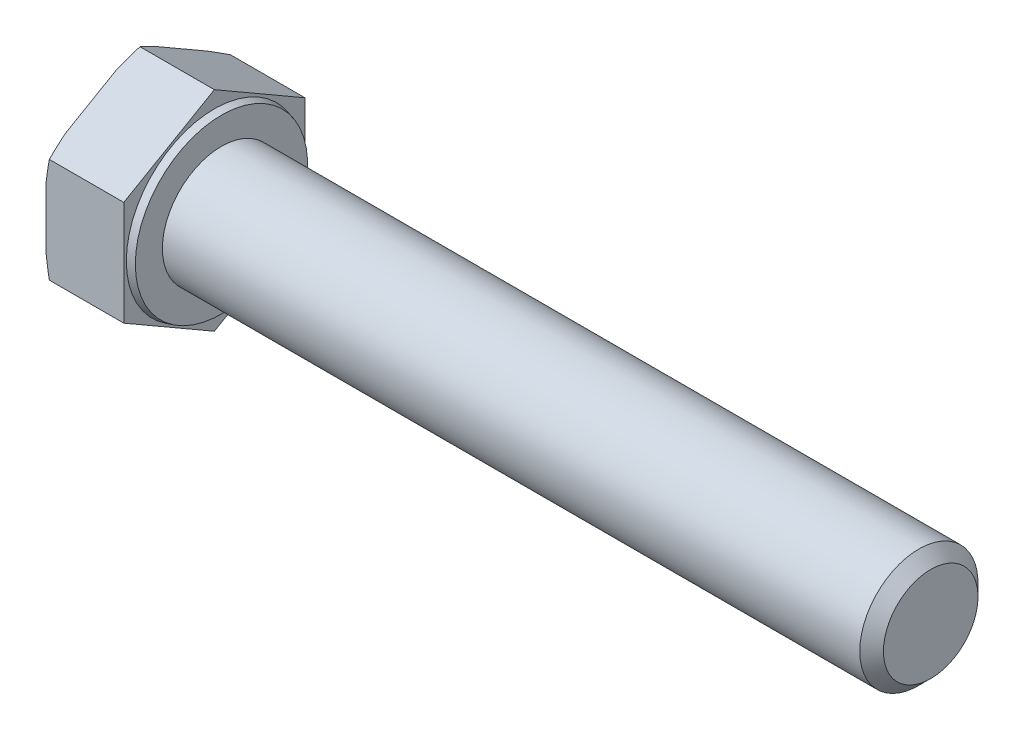
ISO-10303-21;
HEADER;
FILE_DESCRIPTION(('STEP AP214'),'2;1');
FILE_NAME('part.step','',(''),(''),'','','');
FILE_SCHEMA(('AUTOMOTIVE_DESIGN { 1 0 10303 214 1 1 1 1 }'));
ENDSEC;
DATA;
#1=APPLICATION_CONTEXT('core data for automotive mechanical design processes');
#2=APPLICATION_PROTOCOL_DEFINITION('international standard','automotive_design',2000,#1);
#3=PRODUCT_CONTEXT('',#1,'mechanical');
#4=PRODUCT('Part','Part','',(#3));
#5=PRODUCT_RELATED_PRODUCT_CATEGORY('part','',(#4));
#6=PRODUCT_DEFINITION_FORMATION('','',#4);
#7=PRODUCT_DEFINITION_CONTEXT('part definition',#1,'design');
#8=PRODUCT_DEFINITION('design','',#6,#7);
#9=PRODUCT_DEFINITION_SHAPE('','',#8);
#10=(LENGTH_UNIT() NAMED_UNIT(*) SI_UNIT(.MILLI.,.METRE.));
#11=(NAMED_UNIT(*) PLANE_ANGLE_UNIT() SI_UNIT($,.RADIAN.));
#12=(NAMED_UNIT(*) SI_UNIT($,.STERADIAN.) SOLID_ANGLE_UNIT());
#13=UNCERTAINTY_MEASURE_WITH_UNIT(LENGTH_MEASURE(1.E-05),#10,'distance_accuracy_value','');
#14=(GEOMETRIC_REPRESENTATION_CONTEXT(3) GLOBAL_UNCERTAINTY_ASSIGNED_CONTEXT((#13)) GLOBAL_UNIT_ASSIGNED_CONTEXT((#10,
#11,#12)) REPRESENTATION_CONTEXT('',''));
#15=CARTESIAN_POINT('',(0.,0.,0.));
#16=DIRECTION('',(0.,0.,1.));
#17=DIRECTION('',(1.,0.,0.));
#18=AXIS2_PLACEMENT_3D('',#15,#16,#17);
#19=CARTESIAN_POINT('',(60.6,-4.42500000000009,-7.66432482349223));
#20=DIRECTION('',(0.,-0.866025403784441,-0.499999999999995));
#21=DIRECTION('',(0.,0.499999999999995,-0.866025403784442));
#22=AXIS2_PLACEMENT_3D('',#19,#20,#21);
#23=PLANE('',#22);
#24=DIRECTION('',(-1.,0.,0.));
#25=VECTOR('',#24,1.);
#26=CARTESIAN_POINT('',(60.6,-8.85,0.));
#27=LINE('',#26,#25);
#28=CARTESIAN_POINT('',(0.,-8.85,0.));
#29=VERTEX_POINT('',#28);
#30=CARTESIAN_POINT('',(-6.29792306844368,-8.85,0.));
#31=VERTEX_POINT('',#30);
#32=EDGE_CURVE('E157',#29,#31,#27,.T.);
#33=ORIENTED_EDGE('',*,*,#32,.T.);
#34=CARTESIAN_POINT('',(-4.7699615006699,-11.9174022332107,5.3128965151713));
#35=CARTESIAN_POINT('',(-4.83614833570257,-11.8050473190038,5.11829209528478));
#36=CARTESIAN_POINT('',(-4.90167255003095,-11.6925948603644,4.92351872348535));
#37=CARTESIAN_POINT('',(-5.03118559698242,-11.4674663528304,4.53358471020429));
#38=CARTESIAN_POINT('',(-5.09517439305191,-11.3547902986816,4.33842405962226));
#39=CARTESIAN_POINT('',(-5.28456041407138,-11.0163157536771,3.75216895060564));
#40=CARTESIAN_POINT('',(-5.40733223857273,-10.7901468045144,3.3604328395613));
#41=CARTESIAN_POINT('',(-5.6448059473252,-10.3342684187143,2.57082831328319));
#42=CARTESIAN_POINT('',(-5.75941225873481,-10.1045464495324,2.17293819104533));
#43=CARTESIAN_POINT('',(-5.97591685440881,-9.6436033227612,1.3745612760779));
#44=CARTESIAN_POINT('',(-6.07781581130404,-9.41238224520545,0.974074621970506));
#45=CARTESIAN_POINT('',(-6.26134144326315,-8.95638364479249,0.184261877874952));
#46=CARTESIAN_POINT('',(-6.34355573274743,-8.73166601658845,-0.204960471530827));
#47=CARTESIAN_POINT('',(-6.48746045966097,-8.2805512783751,-0.986314118159489));
#48=CARTESIAN_POINT('',(-6.54915189984519,-8.05415425097467,-1.37844527229961));
#49=CARTESIAN_POINT('',(-6.62254434564547,-7.71410474496151,-1.96742829380309));
#50=CARTESIAN_POINT('',(-6.64378861584913,-7.60095958105454,-2.16340146632068));
#51=CARTESIAN_POINT('',(-6.67950592063896,-7.37440457175732,-2.55580625313272));
#52=CARTESIAN_POINT('',(-6.69397933196105,-7.26099474144627,-2.75223784130921));
#53=CARTESIAN_POINT('',(-6.71577657593379,-7.03401139991638,-3.14538452131075));
#54=CARTESIAN_POINT('',(-6.72310096885371,-6.92043790222292,-3.34209958970914));
#55=CARTESIAN_POINT('',(-6.73040192529392,-6.69323186195545,-3.73563199523893));
#56=CARTESIAN_POINT('',(-6.73037853713207,-6.57959931977464,-3.93244933168932));
#57=CARTESIAN_POINT('',(-6.72320871548941,-6.35929562962563,-4.31402651612232));
#58=CARTESIAN_POINT('',(-6.71649505277964,-6.25262090601261,-4.49879255730344));
#59=CARTESIAN_POINT('',(-6.69675463432834,-6.03941600442701,-4.86807427927242));
#60=CARTESIAN_POINT('',(-6.68372760236287,-5.93288583298344,-5.05258994875172));
#61=CARTESIAN_POINT('',(-6.63559663675346,-5.61363013252953,-5.60555704254388));
#62=CARTESIAN_POINT('',(-6.59144268713134,-5.40123548697151,-5.97343535990596));
#63=CARTESIAN_POINT('',(-6.48226269320506,-4.97681311893133,-6.70855646522027));
#64=CARTESIAN_POINT('',(-6.41713860156276,-4.7647919199632,-7.07578795411473));
#65=CARTESIAN_POINT('',(-6.27018625376656,-4.34222339340586,-7.80769811179158));
#66=CARTESIAN_POINT('',(-6.18835790112246,-4.1316760743376,-8.17237676581522));
#67=CARTESIAN_POINT('',(-6.00866271800198,-3.70472589760515,-8.91187616421634));
#68=CARTESIAN_POINT('',(-5.91033992742069,-3.48837165185492,-9.286612710289));
#69=CARTESIAN_POINT('',(-5.70311989656312,-3.05693413716248,-10.0338844060276));
#70=CARTESIAN_POINT('',(-5.59422212603359,-2.84185093252738,-10.4064194443103));
#71=CARTESIAN_POINT('',(-5.36943684134144,-2.41473283183158,-11.1462096955477));
#72=CARTESIAN_POINT('',(-5.25362330968472,-2.2026881429877,-11.5134818701005));
#73=CARTESIAN_POINT('',(-5.07537550670142,-1.88529185166037,-12.0632283728134));
#74=CARTESIAN_POINT('',(-5.01521325258259,-1.77961882394802,-12.2462594258008));
#75=CARTESIAN_POINT('',(-4.89354912869936,-1.56846779942573,-12.6119837283436));
#76=CARTESIAN_POINT('',(-4.83204728425027,-1.462989798971,-12.794676984212));
#77=CARTESIAN_POINT('',(-4.7699615006699,-1.35759776678936,-12.9772213386635));
#78=B_SPLINE_CURVE_WITH_KNOTS('',3,(#34,#35,#36,#37,#38,#39,#40,#41,#42,#43,#44,#45,#46,#47,#48,
#49,#50,#51,#52,#53,#54,#55,#56,#57,#58,#59,#60,#61,#62,#63,#64,#65,#66,#67,#68,#69,#70,#71,#72,
#73,#74,#75,#76,#77),.UNSPECIFIED.,.F.,.F.,(4,2,2,2,2,2,2,2,2,2,2,2,2,2,2,2,2,2,2,2,2,4),(0.,
0.70276173034238,1.40554017472233,2.81157217612387,4.23201032618944,5.6523732571052,
7.02270828812481,8.39297635416766,9.07474696516833,9.75647963740091,10.438158877887,
11.119833635759,11.7601005309412,12.4003954417532,13.6809617128842,14.9676044823533,
16.2542546841745,17.5852978857349,18.9164078632869,20.2352036230902,20.894426976119,
21.553637882061),.UNSPECIFIED.);
#79=CARTESIAN_POINT('',(-6.58000000000003,-7.90869530364146,-1.63038755949604));
#80=VERTEX_POINT('',#79);
#81=EDGE_CURVE('E202',#31,#80,#78,.T.);
#82=ORIENTED_EDGE('',*,*,#81,.T.);
#83=DIRECTION('',(0.,-0.499999999999995,0.866025403784442));
#84=VECTOR('',#83,1.);
#85=CARTESIAN_POINT('',(-6.58,-4.42500000000009,-7.66432482349223));
#86=LINE('',#85,#84);
#87=CARTESIAN_POINT('',(-6.58,-5.36630469635854,-6.03393726399618));
#88=VERTEX_POINT('',#87);
#89=EDGE_CURVE('E212',#88,#80,#86,.T.);
#90=ORIENTED_EDGE('',*,*,#89,.F.);
#91=CARTESIAN_POINT('',(-6.29792306844368,-4.42500000000009,-7.66432482349223));
#92=VERTEX_POINT('',#91);
#93=EDGE_CURVE('E215',#88,#92,#78,.T.);
#94=ORIENTED_EDGE('',*,*,#93,.T.);
#95=DIRECTION('',(-1.,0.,0.));
#96=VECTOR('',#95,1.);
#97=CARTESIAN_POINT('',(60.6,-4.42500000000009,-7.66432482349223));
#98=LINE('',#97,#96);
#99=CARTESIAN_POINT('',(0.,-4.42500000000009,-7.66432482349223));
#100=VERTEX_POINT('',#99);
#101=EDGE_CURVE('E168',#100,#92,#98,.T.);
#102=ORIENTED_EDGE('',*,*,#101,.F.);
#103=DIRECTION('',(0.,-0.499999999999995,0.866025403784442));
#104=VECTOR('',#103,1.);
#105=CARTESIAN_POINT('',(0.,-4.42500000000009,-7.66432482349223));
#106=LINE('',#105,#104);
#107=EDGE_CURVE('E183',#100,#29,#106,.T.);
#108=ORIENTED_EDGE('',*,*,#107,.T.);
#109=EDGE_LOOP('',(#33,#82,#90,#94,#102,#108));
#110=FACE_BOUND('',#109,.T.);
#111=ADVANCED_FACE('F35',(#110),#23,.T.);
#112=CARTESIAN_POINT('',(60.6,4.42499999999993,-7.66432482349232));
#113=DIRECTION('',(0.,0.,-1.));
#114=DIRECTION('',(0.,1.,0.));
#115=AXIS2_PLACEMENT_3D('',#112,#113,#114);
#116=PLANE('',#115);
#117=ORIENTED_EDGE('',*,*,#101,.T.);
#118=CARTESIAN_POINT('',(-5.00864005639831,-9.73789651517145,-7.66432482349217));
#119=CARTESIAN_POINT('',(-5.07003318744064,-9.52322769233334,-7.66432482349218));
#120=CARTESIAN_POINT('',(-5.13071664914256,-9.30835600664128,-7.66432482349218));
#121=CARTESIAN_POINT('',(-5.2504442425723,-8.87815277711283,-7.66432482349218));
#122=CARTESIAN_POINT('',(-5.30948834652955,-8.66282122555281,-7.66432482349219));
#123=CARTESIAN_POINT('',(-5.48387527888684,-8.01589307910885,-7.66432482349219));
#124=CARTESIAN_POINT('',(-5.59642298983084,-7.58353558067021,-7.6643248234922));
#125=CARTESIAN_POINT('',(-5.81266226723173,-6.71259000391773,-7.66432482349221));
#126=CARTESIAN_POINT('',(-5.91626806915323,-6.27398046842187,-7.66432482349221));
#127=CARTESIAN_POINT('',(-6.11029091280608,-5.39384656433909,-7.66432482349222));
#128=CARTESIAN_POINT('',(-6.20070892550878,-4.95232241284974,-7.66432482349222));
#129=CARTESIAN_POINT('',(-6.36160933963008,-4.08051166755351,-7.66432482349223));
#130=CARTESIAN_POINT('',(-6.43264625776086,-3.65032885049375,-7.66432482349224));
#131=CARTESIAN_POINT('',(-6.55428187483288,-2.78707107422335,-7.66432482349225));
#132=CARTESIAN_POINT('',(-6.60488453148917,-2.35399669158535,-7.66432482349225));
#133=CARTESIAN_POINT('',(-6.66240831794471,-1.70368188145931,-7.66432482349226));
#134=CARTESIAN_POINT('',(-6.67850532779577,-1.48723464984804,-7.66432482349226));
#135=CARTESIAN_POINT('',(-6.70429433272965,-1.05396299728827,-7.66432482349227));
#136=CARTESIAN_POINT('',(-6.71398664875919,-0.837138595786226,-7.66432482349227));
#137=CARTESIAN_POINT('',(-6.72672253024382,-0.403302294793051,-7.66432482349227));
#138=CARTESIAN_POINT('',(-6.72976638437883,-0.186290403852155,-7.66432482349227));
#139=CARTESIAN_POINT('',(-6.7291358967764,0.247718950123678,-7.66432482349228));
#140=CARTESIAN_POINT('',(-6.72546155695146,0.464716413162706,-7.66432482349228));
#141=CARTESIAN_POINT('',(-6.70624362970486,1.06036953223341,-7.66432482349229));
#142=CARTESIAN_POINT('',(-6.68388895075078,1.43882252598365,-7.66432482349229));
#143=CARTESIAN_POINT('',(-6.62050559151052,2.19412494594648,-7.6643248234923));
#144=CARTESIAN_POINT('',(-6.57947609181733,2.57097430106276,-7.6643248234923));
#145=CARTESIAN_POINT('',(-6.48113797206862,3.32388976987407,-7.66432482349231));
#146=CARTESIAN_POINT('',(-6.4237712185853,3.69994816672772,-7.66432482349232));
#147=CARTESIAN_POINT('',(-6.2956564145037,4.44978573942378,-7.66432482349232));
#148=CARTESIAN_POINT('',(-6.22490691200718,4.82356466341955,-7.66432482349233));
#149=CARTESIAN_POINT('',(-6.0704014797458,5.58003633732887,-7.66432482349234));
#150=CARTESIAN_POINT('',(-5.98632024183774,5.96266195818458,-7.66432482349234));
#151=CARTESIAN_POINT('',(-5.80919867667365,6.72583533235177,-7.66432482349235));
#152=CARTESIAN_POINT('',(-5.71615790531566,7.10638298167437,-7.66432482349235));
#153=CARTESIAN_POINT('',(-5.52374117974904,7.86297645537245,-7.66432482349236));
#154=CARTESIAN_POINT('',(-5.42441511026811,8.23903503370974,-7.66432482349236));
#155=CARTESIAN_POINT('',(-5.27134102225385,8.80195695976291,-7.66432482349237));
#156=CARTESIAN_POINT('',(-5.21964171692946,8.98938164843282,-7.66432482349237));
#157=CARTESIAN_POINT('',(-5.11502150400523,9.36388780999383,-7.66432482349237));
#158=CARTESIAN_POINT('',(-5.06210060924165,9.55096928646908,-7.66432482349238));
#159=CARTESIAN_POINT('',(-5.00864005639831,9.73789651517129,-7.66432482349238));
#160=B_SPLINE_CURVE_WITH_KNOTS('',3,(#118,#119,#120,#121,#122,#123,#124,#125,#126,#127,#128,
#129,#130,#131,#132,#133,#134,#135,#136,#137,#138,#139,#140,#141,#142,#143,#144,#145,#146,#147,
#148,#149,#150,#151,#152,#153,#154,#155,#156,#157,#158,#159),.UNSPECIFIED.,.F.,.F.,(4,2,2,2,2,2,
2,2,2,2,2,2,2,2,2,2,2,2,2,2,4),(0.,0.669823290546161,1.33965792092904,2.67986595636369,
4.03175825312792,5.38355096443301,6.69120700403605,7.99860965473741,8.64966414612008,
9.300686009923,9.95167960543101,10.6026730156168,11.7394565125237,12.876289893615,
14.0172201663474,15.1582742899967,16.3334026116279,17.5085892114817,18.6753990362947,
19.2586689197893,19.8419326771629),.UNSPECIFIED.);
#161=CARTESIAN_POINT('',(-6.58000000000003,-2.54239060728318,-7.66432482349217));
#162=VERTEX_POINT('',#161);
#163=EDGE_CURVE('E223',#92,#162,#160,.T.);
#164=ORIENTED_EDGE('',*,*,#163,.T.);
#165=DIRECTION('',(0.,-1.,0.));
#166=VECTOR('',#165,1.);
#167=CARTESIAN_POINT('',(-6.58,4.42499999999993,-7.66432482349232));
#168=LINE('',#167,#166);
#169=CARTESIAN_POINT('',(-6.58,2.54239060728305,-7.6643248234923));
#170=VERTEX_POINT('',#169);
#171=EDGE_CURVE('E163',#170,#162,#168,.T.);
#172=ORIENTED_EDGE('',*,*,#171,.F.);
#173=CARTESIAN_POINT('',(-6.29792306844368,4.42499999999993,-7.66432482349232));
#174=VERTEX_POINT('',#173);
#175=EDGE_CURVE('E50',#170,#174,#160,.T.);
#176=ORIENTED_EDGE('',*,*,#175,.T.);
#177=DIRECTION('',(-1.,0.,0.));
#178=VECTOR('',#177,1.);
#179=CARTESIAN_POINT('',(60.6,4.42499999999993,-7.66432482349232));
#180=LINE('',#179,#178);
#181=CARTESIAN_POINT('',(0.,4.42499999999993,-7.66432482349232));
#182=VERTEX_POINT('',#181);
#183=EDGE_CURVE('E154',#182,#174,#180,.T.);
#184=ORIENTED_EDGE('',*,*,#183,.F.);
#185=DIRECTION('',(0.,-1.,0.));
#186=VECTOR('',#185,1.);
#187=CARTESIAN_POINT('',(0.,8.84999999999992,-7.66432482349237));
#188=LINE('',#187,#186);
#189=EDGE_CURVE('E181',#182,#100,#188,.T.);
#190=ORIENTED_EDGE('',*,*,#189,.T.);
#191=EDGE_LOOP('',(#117,#164,#172,#176,#184,#190));
#192=FACE_BOUND('',#191,.T.);
#193=ADVANCED_FACE('F250',(#192),#116,.T.);
#194=CARTESIAN_POINT('',(60.6,8.85,0.));
#195=DIRECTION('',(0.,0.866025403784434,-0.500000000000007));
#196=DIRECTION('',(0.,0.500000000000007,0.866025403784435));
#197=AXIS2_PLACEMENT_3D('',#194,#195,#196);
#198=PLANE('',#197);
#199=ORIENTED_EDGE('',*,*,#183,.T.);
#200=CARTESIAN_POINT('',(-4.76996150066986,1.35759776678906,-12.9772213386637));
#201=CARTESIAN_POINT('',(-4.83614833570253,1.46995268099604,-12.7826169187772));
#202=CARTESIAN_POINT('',(-4.9016725500309,1.58240513963541,-12.5878435469777));
#203=CARTESIAN_POINT('',(-5.03118559698238,1.80753364716942,-12.1979095336967));
#204=CARTESIAN_POINT('',(-5.09517439305187,1.92020970131819,-12.0027488831146));
#205=CARTESIAN_POINT('',(-5.28456041407135,2.25868424632273,-11.416493774098));
#206=CARTESIAN_POINT('',(-5.40733223857269,2.48485319548548,-11.0247576630537));
#207=CARTESIAN_POINT('',(-5.64480594732518,2.94073158128551,-10.2351531367756));
#208=CARTESIAN_POINT('',(-5.75941225873478,3.17045355046743,-9.83726301453771));
#209=CARTESIAN_POINT('',(-5.97591685440879,3.63139667723867,-9.03888609957028));
#210=CARTESIAN_POINT('',(-6.07781581130402,3.86261775479443,-8.63839944546289));
#211=CARTESIAN_POINT('',(-6.26134144326313,4.3186163552074,-7.84858670136733));
#212=CARTESIAN_POINT('',(-6.34355573274742,4.54333398341145,-7.45936435196155));
#213=CARTESIAN_POINT('',(-6.48746045966097,4.99444872162482,-6.67801070533289));
#214=CARTESIAN_POINT('',(-6.54915189984519,5.22084574902526,-6.28587955119277));
#215=CARTESIAN_POINT('',(-6.62254434564547,5.56089525503842,-5.69689652968929));
#216=CARTESIAN_POINT('',(-6.64378861584913,5.6740404189454,-5.5009233571717));
#217=CARTESIAN_POINT('',(-6.67950592063896,5.90059542824263,-5.10851857035966));
#218=CARTESIAN_POINT('',(-6.69397933196106,6.01400525855368,-4.91208698218317));
#219=CARTESIAN_POINT('',(-6.7157765759338,6.24098860008357,-4.51894030218163));
#220=CARTESIAN_POINT('',(-6.72310096885372,6.35456209777704,-4.32222523378324));
#221=CARTESIAN_POINT('',(-6.73040192529394,6.58176813804451,-3.92869282825345));
#222=CARTESIAN_POINT('',(-6.73037853713208,6.69540068022533,-3.73187549180306));
#223=CARTESIAN_POINT('',(-6.72320871548943,6.91570437037435,-3.35029830737006));
#224=CARTESIAN_POINT('',(-6.71649505277966,7.02237909398737,-3.16553226618894));
#225=CARTESIAN_POINT('',(-6.69675463432836,7.23558399557298,-2.79625054421994));
#226=CARTESIAN_POINT('',(-6.68372760236289,7.34211416701656,-2.61173487474064));
#227=CARTESIAN_POINT('',(-6.63559663675348,7.66136986747048,-2.05876778094847));
#228=CARTESIAN_POINT('',(-6.59144268713136,7.87376451302852,-1.69088946358639));
#229=CARTESIAN_POINT('',(-6.48226269320508,8.29818688106872,-0.955768358272067));
#230=CARTESIAN_POINT('',(-6.41713860156277,8.51020808003686,-0.588536869377594));
#231=CARTESIAN_POINT('',(-6.27018625376657,8.93277660659422,0.143373288299262));
#232=CARTESIAN_POINT('',(-6.18835790112246,9.14332392566248,0.508051942322907));
#233=CARTESIAN_POINT('',(-6.00866271800198,9.57027410239495,1.24755134072404));
#234=CARTESIAN_POINT('',(-5.91033992742068,9.7866283481452,1.62228788679671));
#235=CARTESIAN_POINT('',(-5.7031198965631,10.2180658628377,2.36955958253528));
#236=CARTESIAN_POINT('',(-5.59422212603357,10.4331490674728,2.74209462081801));
#237=CARTESIAN_POINT('',(-5.36943684134141,10.8602671681686,3.48188487205548));
#238=CARTESIAN_POINT('',(-5.25362330968469,11.0723118570125,3.84915704660823));
#239=CARTESIAN_POINT('',(-5.07537550670138,11.3897081483398,4.39890354932111));
#240=CARTESIAN_POINT('',(-5.01521325258256,11.4953811760522,4.58193460230855));
#241=CARTESIAN_POINT('',(-4.89354912869931,11.7065322005745,4.94765890485139));
#242=CARTESIAN_POINT('',(-4.83204728425022,11.8120102010292,5.13035216071975));
#243=CARTESIAN_POINT('',(-4.76996150066986,11.9174022332109,5.3128965151713));
#244=B_SPLINE_CURVE_WITH_KNOTS('',3,(#200,#201,#202,#203,#204,#205,#206,#207,#208,#209,#210,
#211,#212,#213,#214,#215,#216,#217,#218,#219,#220,#221,#222,#223,#224,#225,#226,#227,#228,#229,
#230,#231,#232,#233,#234,#235,#236,#237,#238,#239,#240,#241,#242,#243),.UNSPECIFIED.,.F.,.F.,(4,
2,2,2,2,2,2,2,2,2,2,2,2,2,2,2,2,2,2,2,2,4),(0.,0.702761730342387,1.40554017472235,
2.8115721761239,4.23201032618948,5.65237325710526,7.02270828812488,8.39297635416775,
9.07474696516843,9.75647963740101,10.4381588778871,11.1198336357591,11.7601005309413,
12.4003954417533,13.6809617128843,14.9676044823535,16.2542546841748,17.5852978857351,
18.9164078632872,20.2352036230905,20.8944269761194,21.5536378820614),.UNSPECIFIED.);
#245=CARTESIAN_POINT('',(-6.58000000000003,5.36630469635833,-6.03393726399625));
#246=VERTEX_POINT('',#245);
#247=EDGE_CURVE('E245',#174,#246,#244,.T.);
#248=ORIENTED_EDGE('',*,*,#247,.T.);
#249=DIRECTION('',(0.,-0.500000000000007,-0.866025403784435));
#250=VECTOR('',#249,1.);
#251=CARTESIAN_POINT('',(-6.58,8.85,0.));
#252=LINE('',#251,#250);
#253=CARTESIAN_POINT('',(-6.58,7.90869530364155,-1.63038755949607));
#254=VERTEX_POINT('',#253);
#255=EDGE_CURVE('E235',#254,#246,#252,.T.);
#256=ORIENTED_EDGE('',*,*,#255,.F.);
#257=CARTESIAN_POINT('',(-6.29792306844368,8.85,0.));
#258=VERTEX_POINT('',#257);
#259=EDGE_CURVE('E58',#254,#258,#244,.T.);
#260=ORIENTED_EDGE('',*,*,#259,.T.);
#261=DIRECTION('',(-1.,0.,0.));
#262=VECTOR('',#261,1.);
#263=CARTESIAN_POINT('',(60.6,8.85,0.));
#264=LINE('',#263,#262);
#265=CARTESIAN_POINT('',(0.,8.85,0.));
#266=VERTEX_POINT('',#265);
#267=EDGE_CURVE('E151',#266,#258,#264,.T.);
#268=ORIENTED_EDGE('',*,*,#267,.F.);
#269=DIRECTION('',(0.,-0.500000000000007,-0.866025403784435));
#270=VECTOR('',#269,1.);
#271=CARTESIAN_POINT('',(0.,8.85000000000003,0.));
#272=LINE('',#271,#270);
#273=EDGE_CURVE('E179',#266,#182,#272,.T.);
#274=ORIENTED_EDGE('',*,*,#273,.T.);
#275=EDGE_LOOP('',(#199,#248,#256,#260,#268,#274));
#276=FACE_BOUND('',#275,.T.);
#277=ADVANCED_FACE('F243',(#276),#198,.T.);
#278=CARTESIAN_POINT('',(60.6,4.42500000000004,7.66432482349226));
#279=DIRECTION('',(0.,0.866025403784441,0.499999999999995));
#280=DIRECTION('',(0.,-0.499999999999995,0.866025403784442));
#281=AXIS2_PLACEMENT_3D('',#278,#279,#280);
#282=PLANE('',#281);
#283=ORIENTED_EDGE('',*,*,#267,.T.);
#284=CARTESIAN_POINT('',(-4.76996150066987,11.9174022332108,-5.31289651517142));
#285=CARTESIAN_POINT('',(-4.83614833570254,11.8050473190038,-5.1182920952849));
#286=CARTESIAN_POINT('',(-4.90167255003092,11.6925948603644,-4.92351872348547));
#287=CARTESIAN_POINT('',(-5.03118559698239,11.4674663528304,-4.53358471020441));
#288=CARTESIAN_POINT('',(-5.09517439305188,11.3547902986817,-4.33842405962238));
#289=CARTESIAN_POINT('',(-5.28456041407136,11.0163157536771,-3.75216895060575));
#290=CARTESIAN_POINT('',(-5.40733223857271,10.7901468045144,-3.36043283956141));
#291=CARTESIAN_POINT('',(-5.64480594732519,10.3342684187144,-2.5708283132833));
#292=CARTESIAN_POINT('',(-5.75941225873479,10.1045464495324,-2.17293819104543));
#293=CARTESIAN_POINT('',(-5.9759168544088,9.64360332276122,-1.374561276078));
#294=CARTESIAN_POINT('',(-6.07781581130403,9.41238224520547,-0.974074621970603));
#295=CARTESIAN_POINT('',(-6.26134144326314,8.95638364479251,-0.184261877875045));
#296=CARTESIAN_POINT('',(-6.34355573274742,8.73166601658846,0.204960471530737));
#297=CARTESIAN_POINT('',(-6.48746045966097,8.28055127837511,0.986314118159404));
#298=CARTESIAN_POINT('',(-6.54915189984519,8.05415425097468,1.37844527229953));
#299=CARTESIAN_POINT('',(-6.62254434564547,7.71410474496152,1.96742829380302));
#300=CARTESIAN_POINT('',(-6.64378861584914,7.60095958105455,2.1634014663206));
#301=CARTESIAN_POINT('',(-6.67950592063896,7.37440457175732,2.55580625313264));
#302=CARTESIAN_POINT('',(-6.69397933196106,7.26099474144628,2.75223784130914));
#303=CARTESIAN_POINT('',(-6.7157765759338,7.03401139991639,3.14538452131068));
#304=CARTESIAN_POINT('',(-6.72310096885372,6.92043790222292,3.34209958970907));
#305=CARTESIAN_POINT('',(-6.73040192529394,6.69323186195546,3.73563199523886));
#306=CARTESIAN_POINT('',(-6.73037853713208,6.57959931977464,3.93244933168925));
#307=CARTESIAN_POINT('',(-6.72320871548943,6.35929562962563,4.31402651612225));
#308=CARTESIAN_POINT('',(-6.71649505277966,6.25262090601261,4.49879255730338));
#309=CARTESIAN_POINT('',(-6.69675463432836,6.03941600442701,4.86807427927237));
#310=CARTESIAN_POINT('',(-6.68372760236289,5.93288583298343,5.05258994875167));
#311=CARTESIAN_POINT('',(-6.63559663675348,5.61363013252952,5.60555704254384));
#312=CARTESIAN_POINT('',(-6.59144268713136,5.40123548697149,5.97343535990593));
#313=CARTESIAN_POINT('',(-6.48226269320508,4.9768131189313,6.70855646522025));
#314=CARTESIAN_POINT('',(-6.41713860156277,4.76479191996317,7.07578795411472));
#315=CARTESIAN_POINT('',(-6.27018625376657,4.34222339340582,7.80769811179158));
#316=CARTESIAN_POINT('',(-6.18835790112247,4.13167607433756,8.17237676581522));
#317=CARTESIAN_POINT('',(-6.00866271800198,3.70472589760511,8.91187616421636));
#318=CARTESIAN_POINT('',(-5.91033992742069,3.48837165185487,9.28661271028903));
#319=CARTESIAN_POINT('',(-5.70311989656311,3.05693413716242,10.0338844060276));
#320=CARTESIAN_POINT('',(-5.59422212603358,2.84185093252732,10.4064194443103));
#321=CARTESIAN_POINT('',(-5.36943684134142,2.41473283183151,11.1462096955478));
#322=CARTESIAN_POINT('',(-5.2536233096847,2.20268814298763,11.5134818701005));
#323=CARTESIAN_POINT('',(-5.07537550670139,1.88529185166029,12.0632283728134));
#324=CARTESIAN_POINT('',(-5.01521325258257,1.77961882394793,12.2462594258009));
#325=CARTESIAN_POINT('',(-4.89354912869933,1.56846779942564,12.6119837283437));
#326=CARTESIAN_POINT('',(-4.83204728425023,1.46298979897091,12.7946769842121));
#327=CARTESIAN_POINT('',(-4.76996150066987,1.35759776678926,12.9772213386636));
#328=B_SPLINE_CURVE_WITH_KNOTS('',3,(#284,#285,#286,#287,#288,#289,#290,#291,#292,#293,#294,
#295,#296,#297,#298,#299,#300,#301,#302,#303,#304,#305,#306,#307,#308,#309,#310,#311,#312,#313,
#314,#315,#316,#317,#318,#319,#320,#321,#322,#323,#324,#325,#326,#327),.UNSPECIFIED.,.F.,.F.,(4,
2,2,2,2,2,2,2,2,2,2,2,2,2,2,2,2,2,2,2,2,4),(0.,0.702761730342384,1.40554017472234,
2.81157217612389,4.23201032618947,5.65237325710524,7.02270828812486,8.39297635416772,
9.0747469651684,9.75647963740098,10.4381588778871,11.119833635759,11.7601005309412,
12.4003954417533,13.6809617128843,14.9676044823535,16.2542546841747,17.585297885735,
18.9164078632871,20.2352036230904,20.8944269761193,21.5536378820612),.UNSPECIFIED.);
#329=CARTESIAN_POINT('',(-6.58000000000003,7.90869530364148,1.63038755949594));
#330=VERTEX_POINT('',#329);
#331=EDGE_CURVE('E145',#258,#330,#328,.T.);
#332=ORIENTED_EDGE('',*,*,#331,.T.);
#333=DIRECTION('',(0.,0.499999999999995,-0.866025403784442));
#334=VECTOR('',#333,1.);
#335=CARTESIAN_POINT('',(-6.58,4.42500000000004,7.66432482349226));
#336=LINE('',#335,#334);
#337=CARTESIAN_POINT('',(-6.58,5.36630469635847,6.03393726399624));
#338=VERTEX_POINT('',#337);
#339=EDGE_CURVE('E144',#338,#330,#336,.T.);
#340=ORIENTED_EDGE('',*,*,#339,.F.);
#341=CARTESIAN_POINT('',(-6.29792306844368,4.42500000000004,7.66432482349226));
#342=VERTEX_POINT('',#341);
#343=EDGE_CURVE('E126',#338,#342,#328,.T.);
#344=ORIENTED_EDGE('',*,*,#343,.T.);
#345=DIRECTION('',(-1.,0.,0.));
#346=VECTOR('',#345,1.);
#347=CARTESIAN_POINT('',(60.6,4.42500000000004,7.66432482349226));
#348=LINE('',#347,#346);
#349=CARTESIAN_POINT('',(0.,4.42500000000004,7.66432482349226));
#350=VERTEX_POINT('',#349);
#351=EDGE_CURVE('E140',#350,#342,#348,.T.);
#352=ORIENTED_EDGE('',*,*,#351,.F.);
#353=DIRECTION('',(0.,0.499999999999995,-0.866025403784442));
#354=VECTOR('',#353,1.);
#355=CARTESIAN_POINT('',(0.,8.84999999999997,0.));
#356=LINE('',#355,#354);
#357=EDGE_CURVE('E177',#350,#266,#356,.T.);
#358=ORIENTED_EDGE('',*,*,#357,.T.);
#359=EDGE_LOOP('',(#283,#332,#340,#344,#352,#358));
#360=FACE_BOUND('',#359,.T.);
#361=ADVANCED_FACE('F139',(#360),#282,.T.);
#362=CARTESIAN_POINT('',(60.6,-4.42499999999998,7.66432482349229));
#363=DIRECTION('',(0.,0.,1.));
#364=DIRECTION('',(0.,-1.,0.));
#365=AXIS2_PLACEMENT_3D('',#362,#363,#364);
#366=PLANE('',#365);
#367=ORIENTED_EDGE('',*,*,#351,.T.);
#368=CARTESIAN_POINT('',(-5.00864005639831,9.7378965151714,7.66432482349224));
#369=CARTESIAN_POINT('',(-5.07003318744064,9.52322769233328,7.66432482349224));
#370=CARTESIAN_POINT('',(-5.13071664914256,9.30835600664122,7.66432482349224));
#371=CARTESIAN_POINT('',(-5.2504442425723,8.87815277711278,7.66432482349225));
#372=CARTESIAN_POINT('',(-5.30948834652955,8.66282122555276,7.66432482349225));
#373=CARTESIAN_POINT('',(-5.48387527888684,8.0158930791088,7.66432482349225));
#374=CARTESIAN_POINT('',(-5.59642298983084,7.58353558067016,7.66432482349225));
#375=CARTESIAN_POINT('',(-5.81266226723173,6.71259000391768,7.66432482349225));
#376=CARTESIAN_POINT('',(-5.91626806915323,6.27398046842182,7.66432482349225));
#377=CARTESIAN_POINT('',(-6.11029091280608,5.39384656433903,7.66432482349226));
#378=CARTESIAN_POINT('',(-6.20070892550878,4.95232241284969,7.66432482349226));
#379=CARTESIAN_POINT('',(-6.36160933963008,4.08051166755345,7.66432482349226));
#380=CARTESIAN_POINT('',(-6.43264625776087,3.6503288504937,7.66432482349226));
#381=CARTESIAN_POINT('',(-6.55428187483288,2.7870710742233,7.66432482349227));
#382=CARTESIAN_POINT('',(-6.60488453148917,2.3539966915853,7.66432482349227));
#383=CARTESIAN_POINT('',(-6.66240831794471,1.70368188145926,7.66432482349227));
#384=CARTESIAN_POINT('',(-6.67850532779577,1.48723464984798,7.66432482349227));
#385=CARTESIAN_POINT('',(-6.70429433272965,1.05396299728821,7.66432482349227));
#386=CARTESIAN_POINT('',(-6.71398664875919,0.83713859578617,7.66432482349227));
#387=CARTESIAN_POINT('',(-6.72672253024382,0.403302294792995,7.66432482349227));
#388=CARTESIAN_POINT('',(-6.72976638437883,0.1862904038521,7.66432482349228));
#389=CARTESIAN_POINT('',(-6.7291358967764,-0.247718950123733,7.66432482349228));
#390=CARTESIAN_POINT('',(-6.72546155695146,-0.46471641316276,7.66432482349228));
#391=CARTESIAN_POINT('',(-6.70624362970486,-1.06036953223346,7.66432482349228));
#392=CARTESIAN_POINT('',(-6.68388895075078,-1.43882252598371,7.66432482349228));
#393=CARTESIAN_POINT('',(-6.62050559151052,-2.19412494594653,7.66432482349228));
#394=CARTESIAN_POINT('',(-6.57947609181733,-2.57097430106281,7.66432482349229));
#395=CARTESIAN_POINT('',(-6.48113797206862,-3.32388976987413,7.66432482349229));
#396=CARTESIAN_POINT('',(-6.4237712185853,-3.69994816672777,7.66432482349229));
#397=CARTESIAN_POINT('',(-6.2956564145037,-4.44978573942384,7.66432482349229));
#398=CARTESIAN_POINT('',(-6.22490691200718,-4.8235646634196,7.66432482349229));
#399=CARTESIAN_POINT('',(-6.0704014797458,-5.58003633732892,7.6643248234923));
#400=CARTESIAN_POINT('',(-5.98632024183774,-5.96266195818463,7.6643248234923));
#401=CARTESIAN_POINT('',(-5.80919867667365,-6.72583533235183,7.6643248234923));
#402=CARTESIAN_POINT('',(-5.71615790531566,-7.10638298167442,7.6643248234923));
#403=CARTESIAN_POINT('',(-5.52374117974904,-7.8629764553725,7.66432482349231));
#404=CARTESIAN_POINT('',(-5.42441511026811,-8.2390350337098,7.66432482349231));
#405=CARTESIAN_POINT('',(-5.27134102225385,-8.80195695976297,7.66432482349231));
#406=CARTESIAN_POINT('',(-5.21964171692946,-8.98938164843288,7.66432482349231));
#407=CARTESIAN_POINT('',(-5.11502150400523,-9.36388780999389,7.66432482349231));
#408=CARTESIAN_POINT('',(-5.06210060924165,-9.55096928646914,7.66432482349231));
#409=CARTESIAN_POINT('',(-5.00864005639831,-9.73789651517135,7.66432482349231));
#410=B_SPLINE_CURVE_WITH_KNOTS('',3,(#368,#369,#370,#371,#372,#373,#374,#375,#376,#377,#378,
#379,#380,#381,#382,#383,#384,#385,#386,#387,#388,#389,#390,#391,#392,#393,#394,#395,#396,#397,
#398,#399,#400,#401,#402,#403,#404,#405,#406,#407,#408,#409),.UNSPECIFIED.,.F.,.F.,(4,2,2,2,2,2,
2,2,2,2,2,2,2,2,2,2,2,2,2,2,4),(0.,0.669823290546161,1.33965792092904,2.67986595636369,
4.03175825312792,5.38355096443301,6.69120700403605,7.99860965473742,8.64966414612009,
9.300686009923,9.95167960543102,10.6026730156168,11.7394565125237,12.876289893615,
14.0172201663474,15.1582742899967,16.3334026116279,17.5085892114817,18.6753990362947,
19.2586689197893,19.8419326771629),.UNSPECIFIED.);
#411=CARTESIAN_POINT('',(-6.58000000000003,2.54239060728313,7.66432482349219));
#412=VERTEX_POINT('',#411);
#413=EDGE_CURVE('E123',#342,#412,#410,.T.);
#414=ORIENTED_EDGE('',*,*,#413,.T.);
#415=DIRECTION('',(0.,1.,0.));
#416=VECTOR('',#415,1.);
#417=CARTESIAN_POINT('',(-6.58,-4.42499999999998,7.66432482349229));
#418=LINE('',#417,#416);
#419=CARTESIAN_POINT('',(-6.58,-2.5423906072831,7.66432482349229));
#420=VERTEX_POINT('',#419);
#421=EDGE_CURVE('E221',#420,#412,#418,.T.);
#422=ORIENTED_EDGE('',*,*,#421,.F.);
#423=CARTESIAN_POINT('',(-6.29792306844368,-4.42499999999998,7.66432482349229));
#424=VERTEX_POINT('',#423);
#425=EDGE_CURVE('E133',#420,#424,#410,.T.);
#426=ORIENTED_EDGE('',*,*,#425,.T.);
#427=DIRECTION('',(-1.,0.,0.));
#428=VECTOR('',#427,1.);
#429=CARTESIAN_POINT('',(60.6,-4.42499999999998,7.66432482349229));
#430=LINE('',#429,#428);
#431=CARTESIAN_POINT('',(0.,-4.42499999999998,7.66432482349229));
#432=VERTEX_POINT('',#431);
#433=EDGE_CURVE('E152',#432,#424,#430,.T.);
#434=ORIENTED_EDGE('',*,*,#433,.F.);
#435=DIRECTION('',(0.,1.,0.));
#436=VECTOR('',#435,1.);
#437=CARTESIAN_POINT('',(0.,8.85000000000003,7.66432482349225));
#438=LINE('',#437,#436);
#439=EDGE_CURVE('E150',#432,#350,#438,.T.);
#440=ORIENTED_EDGE('',*,*,#439,.T.);
#441=EDGE_LOOP('',(#367,#414,#422,#426,#434,#440));
#442=FACE_BOUND('',#441,.T.);
#443=ADVANCED_FACE('F147',(#442),#366,.T.);
#444=CARTESIAN_POINT('',(60.6,-8.85,0.));
#445=DIRECTION('',(0.,-0.866025403784438,0.500000000000001));
#446=DIRECTION('',(0.,-0.500000000000001,-0.866025403784438));
#447=AXIS2_PLACEMENT_3D('',#444,#445,#446);
#448=PLANE('',#447);
#449=ORIENTED_EDGE('',*,*,#433,.T.);
#450=CARTESIAN_POINT('',(-4.76996150066987,-1.35759776678916,12.9772213386637));
#451=CARTESIAN_POINT('',(-4.83614833570253,-1.46995268099614,12.7826169187771));
#452=CARTESIAN_POINT('',(-4.90167255003091,-1.58240513963551,12.5878435469777));
#453=CARTESIAN_POINT('',(-5.03118559698238,-1.80753364716952,12.1979095336966));
#454=CARTESIAN_POINT('',(-5.09517439305187,-1.92020970131828,12.0027488831146));
#455=CARTESIAN_POINT('',(-5.28456041407135,-2.25868424632282,11.416493774098));
#456=CARTESIAN_POINT('',(-5.4073322385727,-2.48485319548557,11.0247576630537));
#457=CARTESIAN_POINT('',(-5.64480594732518,-2.94073158128559,10.2351531367755));
#458=CARTESIAN_POINT('',(-5.75941225873479,-3.17045355046751,9.83726301453767));
#459=CARTESIAN_POINT('',(-5.97591685440879,-3.63139667723874,9.03888609957024));
#460=CARTESIAN_POINT('',(-6.07781581130402,-3.8626177547945,8.63839944546285));
#461=CARTESIAN_POINT('',(-6.26134144326314,-4.31861635520747,7.84858670136729));
#462=CARTESIAN_POINT('',(-6.34355573274742,-4.54333398341151,7.45936435196151));
#463=CARTESIAN_POINT('',(-6.48746045966097,-4.99444872162487,6.67801070533284));
#464=CARTESIAN_POINT('',(-6.54915189984519,-5.22084574902531,6.28587955119272));
#465=CARTESIAN_POINT('',(-6.62254434564547,-5.56089525503847,5.69689652968923));
#466=CARTESIAN_POINT('',(-6.64378861584913,-5.67404041894544,5.50092335717165));
#467=CARTESIAN_POINT('',(-6.67950592063896,-5.90059542824267,5.10851857035961));
#468=CARTESIAN_POINT('',(-6.69397933196106,-6.01400525855372,4.91208698218311));
#469=CARTESIAN_POINT('',(-6.7157765759338,-6.24098860008361,4.51894030218158));
#470=CARTESIAN_POINT('',(-6.72310096885372,-6.35456209777708,4.32222523378318));
#471=CARTESIAN_POINT('',(-6.73040192529394,-6.58176813804455,3.92869282825339));
#472=CARTESIAN_POINT('',(-6.73037853713208,-6.69540068022536,3.731875491803));
#473=CARTESIAN_POINT('',(-6.72320871548943,-6.91570437037438,3.35029830737));
#474=CARTESIAN_POINT('',(-6.71649505277966,-7.0223790939874,3.16553226618888));
#475=CARTESIAN_POINT('',(-6.69675463432836,-7.23558399557301,2.79625054421989));
#476=CARTESIAN_POINT('',(-6.68372760236289,-7.34211416701659,2.61173487474059));
#477=CARTESIAN_POINT('',(-6.63559663675348,-7.6613698674705,2.05876778094842));
#478=CARTESIAN_POINT('',(-6.59144268713136,-7.87376451302853,1.69088946358633));
#479=CARTESIAN_POINT('',(-6.48226269320508,-8.29818688106873,0.955768358272008));
#480=CARTESIAN_POINT('',(-6.41713860156277,-8.51020808003686,0.588536869377535));
#481=CARTESIAN_POINT('',(-6.27018625376657,-8.93277660659422,-0.143373288299321));
#482=CARTESIAN_POINT('',(-6.18835790112247,-9.14332392566248,-0.508051942322965));
#483=CARTESIAN_POINT('',(-6.00866271800198,-9.57027410239494,-1.2475513407241));
#484=CARTESIAN_POINT('',(-5.91033992742068,-9.78662834814518,-1.62228788679677));
#485=CARTESIAN_POINT('',(-5.7031198965631,-10.2180658628376,-2.36955958253534));
#486=CARTESIAN_POINT('',(-5.59422212603357,-10.4331490674727,-2.74209462081807));
#487=CARTESIAN_POINT('',(-5.36943684134142,-10.8602671681686,-3.48188487205554));
#488=CARTESIAN_POINT('',(-5.25362330968469,-11.0723118570124,-3.84915704660829));
#489=CARTESIAN_POINT('',(-5.07537550670139,-11.3897081483398,-4.39890354932117));
#490=CARTESIAN_POINT('',(-5.01521325258256,-11.4953811760521,-4.58193460230861));
#491=CARTESIAN_POINT('',(-4.89354912869932,-11.7065322005744,-4.94765890485145));
#492=CARTESIAN_POINT('',(-4.83204728425023,-11.8120102010292,-5.13035216071981));
#493=CARTESIAN_POINT('',(-4.76996150066987,-11.9174022332108,-5.31289651517136));
#494=B_SPLINE_CURVE_WITH_KNOTS('',3,(#450,#451,#452,#453,#454,#455,#456,#457,#458,#459,#460,
#461,#462,#463,#464,#465,#466,#467,#468,#469,#470,#471,#472,#473,#474,#475,#476,#477,#478,#479,
#480,#481,#482,#483,#484,#485,#486,#487,#488,#489,#490,#491,#492,#493),.UNSPECIFIED.,.F.,.F.,(4,
2,2,2,2,2,2,2,2,2,2,2,2,2,2,2,2,2,2,2,2,4),(0.,0.702761730342385,1.40554017472234,
2.81157217612389,4.23201032618948,5.65237325710525,7.02270828812487,8.39297635416773,
9.07474696516841,9.756479637401,10.4381588778871,11.1198336357591,11.7601005309413,
12.4003954417533,13.6809617128843,14.9676044823535,16.2542546841747,17.5852978857351,
18.9164078632871,20.2352036230904,20.8944269761193,21.5536378820613),.UNSPECIFIED.);
#495=CARTESIAN_POINT('',(-6.58000000000003,-5.36630469635837,6.03393726399621));
#496=VERTEX_POINT('',#495);
#497=EDGE_CURVE('E213',#424,#496,#494,.T.);
#498=ORIENTED_EDGE('',*,*,#497,.T.);
#499=DIRECTION('',(0.,0.500000000000001,0.866025403784438));
#500=VECTOR('',#499,1.);
#501=CARTESIAN_POINT('',(-6.58,-8.85,0.));
#502=LINE('',#501,#500);
#503=CARTESIAN_POINT('',(-6.58,-7.90869530364156,1.63038755949602));
#504=VERTEX_POINT('',#503);
#505=EDGE_CURVE('E219',#504,#496,#502,.T.);
#506=ORIENTED_EDGE('',*,*,#505,.F.);
#507=EDGE_CURVE('E204',#504,#31,#494,.T.);
#508=ORIENTED_EDGE('',*,*,#507,.T.);
#509=ORIENTED_EDGE('',*,*,#32,.F.);
#510=DIRECTION('',(0.,0.500000000000001,0.866025403784438));
#511=VECTOR('',#510,1.);
#512=CARTESIAN_POINT('',(0.,-4.42499999999998,7.66432482349229));
#513=LINE('',#512,#511);
#514=EDGE_CURVE('E174',#29,#432,#513,.T.);
#515=ORIENTED_EDGE('',*,*,#514,.T.);
#516=EDGE_LOOP('',(#449,#498,#506,#508,#509,#515));
#517=FACE_BOUND('',#516,.T.);
#518=ADVANCED_FACE('F271',(#517),#448,.T.);
#519=CARTESIAN_POINT('',(-6.58,0.,0.));
#520=DIRECTION('',(1.,0.,0.));
#521=DIRECTION('',(0.,0.,-1.));
#522=AXIS2_PLACEMENT_3D('',#519,#520,#521);
#523=PLANE('',#522);
#524=CARTESIAN_POINT('',(-6.58,0.,0.));
#525=DIRECTION('',(1.,0.,0.));
#526=DIRECTION('',(0.,0.,-1.));
#527=AXIS2_PLACEMENT_3D('',#524,#525,#526);
#528=CIRCLE('',#527,8.07500000000009);
#529=EDGE_CURVE('E188',#170,#246,#528,.T.);
#530=ORIENTED_EDGE('',*,*,#529,.F.);
#531=ORIENTED_EDGE('',*,*,#171,.T.);
#532=EDGE_CURVE('E186',#88,#162,#528,.T.);
#533=ORIENTED_EDGE('',*,*,#532,.F.);
#534=ORIENTED_EDGE('',*,*,#89,.T.);
#535=EDGE_CURVE('E187',#504,#80,#528,.T.);
#536=ORIENTED_EDGE('',*,*,#535,.F.);
#537=ORIENTED_EDGE('',*,*,#505,.T.);
#538=EDGE_CURVE('E194',#420,#496,#528,.T.);
#539=ORIENTED_EDGE('',*,*,#538,.F.);
#540=ORIENTED_EDGE('',*,*,#421,.T.);
#541=CARTESIAN_POINT('',(-6.58000000000003,0.,0.));
#542=DIRECTION('',(-1.,0.,0.));
#543=DIRECTION('',(0.,0.,1.));
#544=AXIS2_PLACEMENT_3D('',#541,#542,#543);
#545=CIRCLE('',#544,8.075);
#546=EDGE_CURVE('E128',#412,#338,#545,.T.);
#547=ORIENTED_EDGE('',*,*,#546,.T.);
#548=ORIENTED_EDGE('',*,*,#339,.T.);
#549=EDGE_CURVE('E192',#254,#330,#528,.T.);
#550=ORIENTED_EDGE('',*,*,#549,.F.);
#551=ORIENTED_EDGE('',*,*,#255,.T.);
#552=EDGE_LOOP('',(#530,#531,#533,#534,#536,#537,#539,#540,#547,#548,#550,#551));
#553=FACE_BOUND('',#552,.T.);
#554=ADVANCED_FACE('F217',(#553),#523,.F.);
#555=CARTESIAN_POINT('',(0.,8.85,0.));
#556=DIRECTION('',(-1.,0.,0.));
#557=DIRECTION('',(0.,0.,1.));
#558=AXIS2_PLACEMENT_3D('',#555,#556,#557);
#559=PLANE('',#558);
#560=CARTESIAN_POINT('',(0.,0.,0.));
#561=DIRECTION('',(-1.,0.,0.));
#562=DIRECTION('',(0.,0.,1.));
#563=AXIS2_PLACEMENT_3D('',#560,#561,#562);
#564=CIRCLE('',#563,7.44897459621555);
#565=CARTESIAN_POINT('',(0.,0.,7.44897459621555));
#566=VERTEX_POINT('',#565);
#567=EDGE_CURVE('E171',#566,#566,#564,.T.);
#568=ORIENTED_EDGE('',*,*,#567,.T.);
#569=EDGE_LOOP('',(#568));
#570=FACE_BOUND('',#569,.T.);
#571=ORIENTED_EDGE('',*,*,#107,.F.);
#572=ORIENTED_EDGE('',*,*,#189,.F.);
#573=ORIENTED_EDGE('',*,*,#273,.F.);
#574=ORIENTED_EDGE('',*,*,#357,.F.);
#575=ORIENTED_EDGE('',*,*,#439,.F.);
#576=ORIENTED_EDGE('',*,*,#514,.F.);
#577=EDGE_LOOP('',(#571,#572,#573,#574,#575,#576));
#578=FACE_BOUND('',#577,.T.);
#579=ADVANCED_FACE('F255',(#570,#578),#559,.F.);
#580=CARTESIAN_POINT('',(0.599999999999934,0.,0.));
#581=DIRECTION('',(-1.,0.,0.));
#582=DIRECTION('',(0.,0.,1.));
#583=AXIS2_PLACEMENT_3D('',#580,#581,#582);
#584=CONICAL_SURFACE('',#583,7.28820508075687,0.261799387799175);
#585=ORIENTED_EDGE('',*,*,#567,.F.);
#586=EDGE_LOOP('',(#585));
#587=FACE_BOUND('',#586,.T.);
#588=CARTESIAN_POINT('',(0.599999999999934,0.,0.));
#589=DIRECTION('',(-1.,0.,0.));
#590=DIRECTION('',(0.,0.,1.));
#591=AXIS2_PLACEMENT_3D('',#588,#589,#590);
#592=CIRCLE('',#591,7.28820508075687);
#593=CARTESIAN_POINT('',(0.599999999999934,0.,7.28820508075687));
#594=VERTEX_POINT('',#593);
#595=EDGE_CURVE('E167',#594,#594,#592,.T.);
#596=ORIENTED_EDGE('',*,*,#595,.T.);
#597=EDGE_LOOP('',(#596));
#598=FACE_BOUND('',#597,.T.);
#599=ADVANCED_FACE('F324',(#587,#598),#584,.T.);
#600=CARTESIAN_POINT('',(0.6,7.28820508075687,0.));
#601=DIRECTION('',(-1.,0.,0.));
#602=DIRECTION('',(0.,0.,1.));
#603=AXIS2_PLACEMENT_3D('',#600,#601,#602);
#604=PLANE('',#603);
#605=ORIENTED_EDGE('',*,*,#595,.F.);
#606=EDGE_LOOP('',(#605));
#607=FACE_BOUND('',#606,.T.);
#608=CARTESIAN_POINT('',(0.599999999999934,0.,0.));
#609=DIRECTION('',(-1.,0.,0.));
#610=DIRECTION('',(0.,0.,1.));
#611=AXIS2_PLACEMENT_3D('',#608,#609,#610);
#612=CIRCLE('',#611,5.);
#613=CARTESIAN_POINT('',(0.599999999999934,0.,5.));
#614=VERTEX_POINT('',#613);
#615=EDGE_CURVE('E164',#614,#614,#612,.T.);
#616=ORIENTED_EDGE('',*,*,#615,.T.);
#617=EDGE_LOOP('',(#616));
#618=FACE_BOUND('',#617,.T.);
#619=ADVANCED_FACE('F321',(#607,#618),#604,.F.);
#620=CARTESIAN_POINT('',(-1000.,0.,0.));
#621=DIRECTION('',(-1.,0.,0.));
#622=DIRECTION('',(0.,0.,1.));
#623=AXIS2_PLACEMENT_3D('',#620,#621,#622);
#624=CYLINDRICAL_SURFACE('',#623,5.);
#625=CARTESIAN_POINT('',(59.6000000000001,0.,0.));
#626=DIRECTION('',(-1.,0.,0.));
#627=DIRECTION('',(0.,0.,1.));
#628=AXIS2_PLACEMENT_3D('',#625,#626,#627);
#629=CIRCLE('',#628,5.);
#630=CARTESIAN_POINT('',(59.6000000000001,0.,5.));
#631=VERTEX_POINT('',#630);
#632=EDGE_CURVE('E43',#631,#631,#629,.T.);
#633=ORIENTED_EDGE('',*,*,#632,.T.);
#634=EDGE_LOOP('',(#633));
#635=FACE_BOUND('',#634,.T.);
#636=ORIENTED_EDGE('',*,*,#615,.F.);
#637=EDGE_LOOP('',(#636));
#638=FACE_BOUND('',#637,.T.);
#639=ADVANCED_FACE('F317',(#635,#638),#624,.T.);
#640=CARTESIAN_POINT('',(60.6,5.,0.));
#641=DIRECTION('',(-1.,0.,0.));
#642=DIRECTION('',(0.,0.,1.));
#643=AXIS2_PLACEMENT_3D('',#640,#641,#642);
#644=PLANE('',#643);
#645=CARTESIAN_POINT('',(60.6,0.,0.));
#646=DIRECTION('',(-1.,0.,0.));
#647=DIRECTION('',(0.,0.,1.));
#648=AXIS2_PLACEMENT_3D('',#645,#646,#647);
#649=CIRCLE('',#648,4.00000000000002);
#650=CARTESIAN_POINT('',(60.6,0.,4.00000000000002));
#651=VERTEX_POINT('',#650);
#652=EDGE_CURVE('E12',#651,#651,#649,.F.);
#653=ORIENTED_EDGE('',*,*,#652,.T.);
#654=EDGE_LOOP('',(#653));
#655=FACE_BOUND('',#654,.T.);
#656=ADVANCED_FACE('F314',(#655),#644,.F.);
#657=CARTESIAN_POINT('',(-6.58000000000003,0.,0.));
#658=DIRECTION('',(1.,0.,0.));
#659=DIRECTION('',(0.,0.,-1.));
#660=AXIS2_PLACEMENT_3D('',#657,#658,#659);
#661=CONICAL_SURFACE('',#660,8.075,1.22173047639598);
#662=ORIENTED_EDGE('',*,*,#532,.T.);
#663=ORIENTED_EDGE('',*,*,#163,.F.);
#664=ORIENTED_EDGE('',*,*,#93,.F.);
#665=EDGE_LOOP('',(#662,#663,#664));
#666=FACE_BOUND('',#665,.T.);
#667=ADVANCED_FACE('F277',(#666),#661,.T.);
#668=ORIENTED_EDGE('',*,*,#507,.F.);
#669=ORIENTED_EDGE('',*,*,#535,.T.);
#670=ORIENTED_EDGE('',*,*,#81,.F.);
#671=EDGE_LOOP('',(#668,#669,#670));
#672=FACE_BOUND('',#671,.T.);
#673=ADVANCED_FACE('F201',(#672),#661,.T.);
#674=ORIENTED_EDGE('',*,*,#538,.T.);
#675=ORIENTED_EDGE('',*,*,#497,.F.);
#676=ORIENTED_EDGE('',*,*,#425,.F.);
#677=EDGE_LOOP('',(#674,#675,#676));
#678=FACE_BOUND('',#677,.T.);
#679=ADVANCED_FACE('F276',(#678),#661,.T.);
#680=ORIENTED_EDGE('',*,*,#546,.F.);
#681=ORIENTED_EDGE('',*,*,#413,.F.);
#682=ORIENTED_EDGE('',*,*,#343,.F.);
#683=EDGE_LOOP('',(#680,#681,#682));
#684=FACE_BOUND('',#683,.T.);
#685=ADVANCED_FACE('F125',(#684),#661,.T.);
#686=ORIENTED_EDGE('',*,*,#549,.T.);
#687=ORIENTED_EDGE('',*,*,#331,.F.);
#688=ORIENTED_EDGE('',*,*,#259,.F.);
#689=EDGE_LOOP('',(#686,#687,#688));
#690=FACE_BOUND('',#689,.T.);
#691=ADVANCED_FACE('F379',(#690),#661,.T.);
#692=ORIENTED_EDGE('',*,*,#529,.T.);
#693=ORIENTED_EDGE('',*,*,#247,.F.);
#694=ORIENTED_EDGE('',*,*,#175,.F.);
#695=EDGE_LOOP('',(#692,#693,#694));
#696=FACE_BOUND('',#695,.T.);
#697=ADVANCED_FACE('F363',(#696),#661,.T.);
#698=CARTESIAN_POINT('',(59.6000000000001,0.,0.));
#699=DIRECTION('',(-1.,0.,0.));
#700=DIRECTION('',(0.,0.,1.));
#701=AXIS2_PLACEMENT_3D('',#698,#699,#700);
#702=CONICAL_SURFACE('',#701,5.,0.785398163397487);
#703=ORIENTED_EDGE('',*,*,#652,.F.);
#704=EDGE_LOOP('',(#703));
#705=FACE_BOUND('',#704,.T.);
#706=ORIENTED_EDGE('',*,*,#632,.F.);
#707=EDGE_LOOP('',(#706));
#708=FACE_BOUND('',#707,.T.);
#709=ADVANCED_FACE('F37',(#705,#708),#702,.T.);
#710=CLOSED_SHELL('',(#111,#193,#277,#361,#443,#518,#554,#579,#599,#619,#639,#656,#667,#673,
#679,#685,#691,#697,#709));
#711=MANIFOLD_SOLID_BREP('B2',#710);
#712=ADVANCED_BREP_SHAPE_REPRESENTATION('',(#18,#711),#14);
#713=SHAPE_DEFINITION_REPRESENTATION(#9,#712);
ENDSEC;
END-ISO-10303-21;
